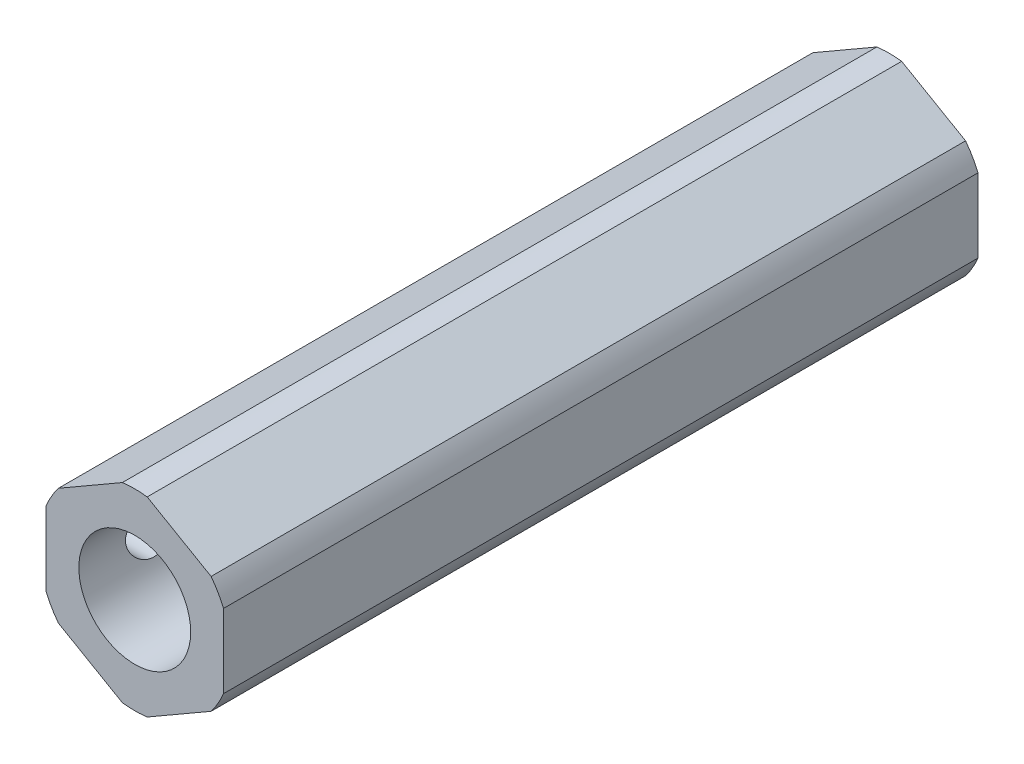
ISO-10303-21;
HEADER;
FILE_DESCRIPTION(('STEP AP214'),'2;1');
FILE_NAME('part.step','',(''),(''),'','','');
FILE_SCHEMA(('AUTOMOTIVE_DESIGN { 1 0 10303 214 1 1 1 1 }'));
ENDSEC;
DATA;
#1=APPLICATION_CONTEXT('core data for automotive mechanical design processes');
#2=APPLICATION_PROTOCOL_DEFINITION('international standard','automotive_design',2000,#1);
#3=PRODUCT_CONTEXT('',#1,'mechanical');
#4=PRODUCT('Part','Part','',(#3));
#5=PRODUCT_RELATED_PRODUCT_CATEGORY('part','',(#4));
#6=PRODUCT_DEFINITION_FORMATION('','',#4);
#7=PRODUCT_DEFINITION_CONTEXT('part definition',#1,'design');
#8=PRODUCT_DEFINITION('design','',#6,#7);
#9=PRODUCT_DEFINITION_SHAPE('','',#8);
#10=(LENGTH_UNIT() NAMED_UNIT(*) SI_UNIT(.MILLI.,.METRE.));
#11=(NAMED_UNIT(*) PLANE_ANGLE_UNIT() SI_UNIT($,.RADIAN.));
#12=(NAMED_UNIT(*) SI_UNIT($,.STERADIAN.) SOLID_ANGLE_UNIT());
#13=UNCERTAINTY_MEASURE_WITH_UNIT(LENGTH_MEASURE(1.E-05),#10,'distance_accuracy_value','');
#14=(GEOMETRIC_REPRESENTATION_CONTEXT(3) GLOBAL_UNCERTAINTY_ASSIGNED_CONTEXT((#13)) GLOBAL_UNIT_ASSIGNED_CONTEXT((#10,
#11,#12)) REPRESENTATION_CONTEXT('',''));
#15=CARTESIAN_POINT('',(0.,0.,0.));
#16=DIRECTION('',(0.,0.,1.));
#17=DIRECTION('',(1.,0.,0.));
#18=AXIS2_PLACEMENT_3D('',#15,#16,#17);
#19=CARTESIAN_POINT('',(0.,0.,-26.9875));
#20=DIRECTION('',(0.,0.,1.));
#21=DIRECTION('',(1.,0.,0.));
#22=AXIS2_PLACEMENT_3D('',#19,#20,#21);
#23=CYLINDRICAL_SURFACE('',#22,2.11582);
#24=CARTESIAN_POINT('',(0.,0.,-26.9875));
#25=DIRECTION('',(0.,0.,1.));
#26=DIRECTION('',(1.,0.,0.));
#27=AXIS2_PLACEMENT_3D('',#24,#25,#26);
#28=CIRCLE('',#27,2.11582);
#29=CARTESIAN_POINT('',(2.11582,0.,-26.9875));
#30=VERTEX_POINT('',#29);
#31=EDGE_CURVE('E166',#30,#30,#28,.T.);
#32=ORIENTED_EDGE('',*,*,#31,.F.);
#33=EDGE_LOOP('',(#32));
#34=FACE_BOUND('',#33,.T.);
#35=CARTESIAN_POINT('',(0.,0.,6.98754));
#36=DIRECTION('',(0.,0.,1.));
#37=DIRECTION('',(1.,0.,0.));
#38=AXIS2_PLACEMENT_3D('',#35,#36,#37);
#39=CIRCLE('',#38,2.11582);
#40=CARTESIAN_POINT('',(2.11582,0.,6.98754));
#41=VERTEX_POINT('',#40);
#42=EDGE_CURVE('E45',#41,#41,#39,.F.);
#43=ORIENTED_EDGE('',*,*,#42,.F.);
#44=EDGE_LOOP('',(#43));
#45=FACE_BOUND('',#44,.T.);
#46=ADVANCED_FACE('F41',(#34,#45),#23,.F.);
#47=CARTESIAN_POINT('',(0.,0.,26.9875));
#48=DIRECTION('',(0.,0.,1.));
#49=DIRECTION('',(1.,0.,0.));
#50=AXIS2_PLACEMENT_3D('',#47,#48,#49);
#51=PLANE('',#50);
#52=CARTESIAN_POINT('',(0.,0.,26.9875));
#53=DIRECTION('',(0.,0.,1.));
#54=DIRECTION('',(1.,0.,0.));
#55=AXIS2_PLACEMENT_3D('',#52,#53,#54);
#56=CIRCLE('',#55,4.);
#57=CARTESIAN_POINT('',(4.,0.,26.9875));
#58=VERTEX_POINT('',#57);
#59=EDGE_CURVE('E261',#58,#58,#56,.T.);
#60=ORIENTED_EDGE('',*,*,#59,.F.);
#61=EDGE_LOOP('',(#60));
#62=FACE_BOUND('',#61,.T.);
#63=CARTESIAN_POINT('',(0.,0.,26.9875));
#64=DIRECTION('',(0.,0.,1.));
#65=DIRECTION('',(1.,0.,0.));
#66=AXIS2_PLACEMENT_3D('',#63,#64,#65);
#67=CIRCLE('',#66,6.87705);
#68=CARTESIAN_POINT('',(5.46158862213451,-4.17909875751589,26.9875));
#69=VERTEX_POINT('',#68);
#70=CARTESIAN_POINT('',(6.35,-2.64032511303059,26.9875));
#71=VERTEX_POINT('',#70);
#72=EDGE_CURVE('E143',#69,#71,#67,.T.);
#73=ORIENTED_EDGE('',*,*,#72,.T.);
#74=DIRECTION('',(0.,1.,0.));
#75=VECTOR('',#74,1.);
#76=CARTESIAN_POINT('',(6.35,-2.64032511303059,26.9875));
#77=LINE('',#76,#75);
#78=CARTESIAN_POINT('',(6.35,2.64032511303059,26.9875));
#79=VERTEX_POINT('',#78);
#80=EDGE_CURVE('E137',#71,#79,#77,.T.);
#81=ORIENTED_EDGE('',*,*,#80,.T.);
#82=CARTESIAN_POINT('',(0.,0.,26.9875));
#83=DIRECTION('',(0.,0.,1.));
#84=DIRECTION('',(1.,0.,0.));
#85=AXIS2_PLACEMENT_3D('',#82,#83,#84);
#86=CIRCLE('',#85,6.87705);
#87=CARTESIAN_POINT('',(5.46158862213451,4.17909875751589,26.9875));
#88=VERTEX_POINT('',#87);
#89=EDGE_CURVE('E140',#79,#88,#86,.T.);
#90=ORIENTED_EDGE('',*,*,#89,.T.);
#91=DIRECTION('',(-0.866025403784439,0.499999999999999,0.));
#92=VECTOR('',#91,1.);
#93=CARTESIAN_POINT('',(5.46158862213451,4.17909875751589,26.9875));
#94=LINE('',#93,#92);
#95=CARTESIAN_POINT('',(0.888411377865485,6.81942387054648,26.9875));
#96=VERTEX_POINT('',#95);
#97=EDGE_CURVE('E59',#88,#96,#94,.T.);
#98=ORIENTED_EDGE('',*,*,#97,.T.);
#99=CARTESIAN_POINT('',(0.,0.,26.9875));
#100=DIRECTION('',(0.,0.,1.));
#101=DIRECTION('',(1.,0.,0.));
#102=AXIS2_PLACEMENT_3D('',#99,#100,#101);
#103=CIRCLE('',#102,6.87705);
#104=CARTESIAN_POINT('',(-0.88841137786549,6.81942387054648,26.9875));
#105=VERTEX_POINT('',#104);
#106=EDGE_CURVE('E190',#96,#105,#103,.T.);
#107=ORIENTED_EDGE('',*,*,#106,.T.);
#108=DIRECTION('',(-0.866025403784439,-0.5,0.));
#109=VECTOR('',#108,1.);
#110=CARTESIAN_POINT('',(-0.88841137786549,6.81942387054648,26.9875));
#111=LINE('',#110,#109);
#112=CARTESIAN_POINT('',(-5.46158862213451,4.17909875751589,26.9875));
#113=VERTEX_POINT('',#112);
#114=EDGE_CURVE('E112',#105,#113,#111,.T.);
#115=ORIENTED_EDGE('',*,*,#114,.T.);
#116=CARTESIAN_POINT('',(0.,0.,26.9875));
#117=DIRECTION('',(0.,0.,1.));
#118=DIRECTION('',(1.,0.,0.));
#119=AXIS2_PLACEMENT_3D('',#116,#117,#118);
#120=CIRCLE('',#119,6.87705);
#121=CARTESIAN_POINT('',(-6.35,2.64032511303059,26.9875));
#122=VERTEX_POINT('',#121);
#123=EDGE_CURVE('E218',#113,#122,#120,.T.);
#124=ORIENTED_EDGE('',*,*,#123,.T.);
#125=DIRECTION('',(0.,-1.,0.));
#126=VECTOR('',#125,1.);
#127=CARTESIAN_POINT('',(-6.35,2.64032511303059,26.9875));
#128=LINE('',#127,#126);
#129=CARTESIAN_POINT('',(-6.35,-2.64032511303059,26.9875));
#130=VERTEX_POINT('',#129);
#131=EDGE_CURVE('E232',#122,#130,#128,.T.);
#132=ORIENTED_EDGE('',*,*,#131,.T.);
#133=CARTESIAN_POINT('',(0.,0.,26.9875));
#134=DIRECTION('',(0.,0.,1.));
#135=DIRECTION('',(1.,0.,0.));
#136=AXIS2_PLACEMENT_3D('',#133,#134,#135);
#137=CIRCLE('',#136,6.87705);
#138=CARTESIAN_POINT('',(-5.46158862213451,-4.17909875751589,26.9875));
#139=VERTEX_POINT('',#138);
#140=EDGE_CURVE('E229',#130,#139,#137,.T.);
#141=ORIENTED_EDGE('',*,*,#140,.T.);
#142=DIRECTION('',(0.866025403784438,-0.5,0.));
#143=VECTOR('',#142,1.);
#144=CARTESIAN_POINT('',(-5.46158862213451,-4.17909875751589,26.9875));
#145=LINE('',#144,#143);
#146=CARTESIAN_POINT('',(-0.888411377865495,-6.81942387054648,26.9875));
#147=VERTEX_POINT('',#146);
#148=EDGE_CURVE('E231',#139,#147,#145,.T.);
#149=ORIENTED_EDGE('',*,*,#148,.T.);
#150=CARTESIAN_POINT('',(0.,0.,26.9875));
#151=DIRECTION('',(0.,0.,1.));
#152=DIRECTION('',(1.,0.,0.));
#153=AXIS2_PLACEMENT_3D('',#150,#151,#152);
#154=CIRCLE('',#153,6.87705);
#155=CARTESIAN_POINT('',(0.888411377865487,-6.81942387054648,26.9875));
#156=VERTEX_POINT('',#155);
#157=EDGE_CURVE('E234',#147,#156,#154,.T.);
#158=ORIENTED_EDGE('',*,*,#157,.T.);
#159=DIRECTION('',(0.866025403784439,0.5,0.));
#160=VECTOR('',#159,1.);
#161=CARTESIAN_POINT('',(0.88841137786549,-6.81942387054648,26.9875));
#162=LINE('',#161,#160);
#163=EDGE_CURVE('E240',#156,#69,#162,.T.);
#164=ORIENTED_EDGE('',*,*,#163,.T.);
#165=EDGE_LOOP('',(#73,#81,#90,#98,#107,#115,#124,#132,#141,#149,#158,#164));
#166=FACE_BOUND('',#165,.T.);
#167=ADVANCED_FACE('F43',(#62,#166),#51,.T.);
#168=CARTESIAN_POINT('',(-0.88841137786549,6.81942387054648,26.9875));
#169=DIRECTION('',(0.5,-0.866025403784439,0.));
#170=DIRECTION('',(0.866025403784439,0.5,0.));
#171=AXIS2_PLACEMENT_3D('',#168,#169,#170);
#172=PLANE('',#171);
#173=DIRECTION('',(0.,0.,-1.));
#174=VECTOR('',#173,1.);
#175=CARTESIAN_POINT('',(-5.46158862213451,4.17909875751589,26.9875));
#176=LINE('',#175,#174);
#177=CARTESIAN_POINT('',(-5.46158862213451,4.17909875751589,-26.9875));
#178=VERTEX_POINT('',#177);
#179=EDGE_CURVE('E51',#113,#178,#176,.T.);
#180=ORIENTED_EDGE('',*,*,#179,.F.);
#181=ORIENTED_EDGE('',*,*,#114,.F.);
#182=DIRECTION('',(0.,0.,-1.));
#183=VECTOR('',#182,1.);
#184=CARTESIAN_POINT('',(-0.88841137786549,6.81942387054648,26.9875));
#185=LINE('',#184,#183);
#186=CARTESIAN_POINT('',(-0.88841137786549,6.81942387054648,-26.9875));
#187=VERTEX_POINT('',#186);
#188=EDGE_CURVE('E11',#105,#187,#185,.T.);
#189=ORIENTED_EDGE('',*,*,#188,.T.);
#190=DIRECTION('',(-0.866025403784439,-0.5,0.));
#191=VECTOR('',#190,1.);
#192=CARTESIAN_POINT('',(-0.88841137786549,6.81942387054648,-26.9875));
#193=LINE('',#192,#191);
#194=EDGE_CURVE('E165',#187,#178,#193,.T.);
#195=ORIENTED_EDGE('',*,*,#194,.T.);
#196=EDGE_LOOP('',(#180,#181,#189,#195));
#197=FACE_BOUND('',#196,.T.);
#198=ADVANCED_FACE('F317',(#197),#172,.F.);
#199=CARTESIAN_POINT('',(-6.35,2.64032511303059,26.9875));
#200=DIRECTION('',(1.,0.,0.));
#201=DIRECTION('',(0.,0.,-1.));
#202=AXIS2_PLACEMENT_3D('',#199,#200,#201);
#203=PLANE('',#202);
#204=CARTESIAN_POINT('',(-6.35,0.,13.98524));
#205=DIRECTION('',(-1.,0.,0.));
#206=DIRECTION('',(0.,0.,1.));
#207=AXIS2_PLACEMENT_3D('',#204,#205,#206);
#208=CIRCLE('',#207,1.66624);
#209=CARTESIAN_POINT('',(-6.35,0.,15.65148));
#210=VERTEX_POINT('',#209);
#211=EDGE_CURVE('E265',#210,#210,#208,.T.);
#212=ORIENTED_EDGE('',*,*,#211,.F.);
#213=EDGE_LOOP('',(#212));
#214=FACE_BOUND('',#213,.T.);
#215=CARTESIAN_POINT('',(-6.35,0.,21.98624));
#216=DIRECTION('',(-1.,0.,0.));
#217=DIRECTION('',(0.,0.,1.));
#218=AXIS2_PLACEMENT_3D('',#215,#216,#217);
#219=CIRCLE('',#218,1.66624);
#220=CARTESIAN_POINT('',(-6.35,0.,23.65248));
#221=VERTEX_POINT('',#220);
#222=EDGE_CURVE('E277',#221,#221,#219,.T.);
#223=ORIENTED_EDGE('',*,*,#222,.F.);
#224=EDGE_LOOP('',(#223));
#225=FACE_BOUND('',#224,.T.);
#226=DIRECTION('',(0.,0.,-1.));
#227=VECTOR('',#226,1.);
#228=CARTESIAN_POINT('',(-6.35,-2.64032511303059,26.9875));
#229=LINE('',#228,#227);
#230=CARTESIAN_POINT('',(-6.35,-2.64032511303059,-26.9875));
#231=VERTEX_POINT('',#230);
#232=EDGE_CURVE('E206',#130,#231,#229,.T.);
#233=ORIENTED_EDGE('',*,*,#232,.F.);
#234=ORIENTED_EDGE('',*,*,#131,.F.);
#235=DIRECTION('',(0.,0.,-1.));
#236=VECTOR('',#235,1.);
#237=CARTESIAN_POINT('',(-6.35,2.64032511303059,26.9875));
#238=LINE('',#237,#236);
#239=CARTESIAN_POINT('',(-6.35,2.64032511303059,-26.9875));
#240=VERTEX_POINT('',#239);
#241=EDGE_CURVE('E209',#122,#240,#238,.T.);
#242=ORIENTED_EDGE('',*,*,#241,.T.);
#243=DIRECTION('',(0.,-1.,0.));
#244=VECTOR('',#243,1.);
#245=CARTESIAN_POINT('',(-6.35,2.64032511303059,-26.9875));
#246=LINE('',#245,#244);
#247=EDGE_CURVE('E171',#240,#231,#246,.T.);
#248=ORIENTED_EDGE('',*,*,#247,.T.);
#249=EDGE_LOOP('',(#233,#234,#242,#248));
#250=FACE_BOUND('',#249,.T.);
#251=ADVANCED_FACE('F223',(#214,#225,#250),#203,.F.);
#252=CARTESIAN_POINT('',(-5.46158862213451,-4.17909875751589,26.9875));
#253=DIRECTION('',(0.5,0.866025403784438,0.));
#254=DIRECTION('',(-0.866025403784439,0.5,0.));
#255=AXIS2_PLACEMENT_3D('',#252,#253,#254);
#256=PLANE('',#255);
#257=DIRECTION('',(0.,0.,-1.));
#258=VECTOR('',#257,1.);
#259=CARTESIAN_POINT('',(-0.888411377865495,-6.81942387054648,26.9875));
#260=LINE('',#259,#258);
#261=CARTESIAN_POINT('',(-0.888411377865495,-6.81942387054648,-26.9875));
#262=VERTEX_POINT('',#261);
#263=EDGE_CURVE('E200',#147,#262,#260,.T.);
#264=ORIENTED_EDGE('',*,*,#263,.F.);
#265=ORIENTED_EDGE('',*,*,#148,.F.);
#266=DIRECTION('',(0.,0.,-1.));
#267=VECTOR('',#266,1.);
#268=CARTESIAN_POINT('',(-5.46158862213451,-4.17909875751589,26.9875));
#269=LINE('',#268,#267);
#270=CARTESIAN_POINT('',(-5.46158862213451,-4.17909875751589,-26.9875));
#271=VERTEX_POINT('',#270);
#272=EDGE_CURVE('E203',#139,#271,#269,.T.);
#273=ORIENTED_EDGE('',*,*,#272,.T.);
#274=DIRECTION('',(0.866025403784438,-0.5,0.));
#275=VECTOR('',#274,1.);
#276=CARTESIAN_POINT('',(-5.46158862213451,-4.17909875751589,-26.9875));
#277=LINE('',#276,#275);
#278=EDGE_CURVE('E176',#271,#262,#277,.T.);
#279=ORIENTED_EDGE('',*,*,#278,.T.);
#280=EDGE_LOOP('',(#264,#265,#273,#279));
#281=FACE_BOUND('',#280,.T.);
#282=ADVANCED_FACE('F306',(#281),#256,.F.);
#283=CARTESIAN_POINT('',(0.88841137786549,-6.81942387054648,26.9875));
#284=DIRECTION('',(-0.5,0.866025403784439,0.));
#285=DIRECTION('',(-0.866025403784439,-0.5,0.));
#286=AXIS2_PLACEMENT_3D('',#283,#284,#285);
#287=PLANE('',#286);
#288=DIRECTION('',(0.,0.,-1.));
#289=VECTOR('',#288,1.);
#290=CARTESIAN_POINT('',(5.46158862213451,-4.17909875751589,26.9875));
#291=LINE('',#290,#289);
#292=CARTESIAN_POINT('',(5.46158862213451,-4.17909875751589,-26.9875));
#293=VERTEX_POINT('',#292);
#294=EDGE_CURVE('E194',#69,#293,#291,.T.);
#295=ORIENTED_EDGE('',*,*,#294,.F.);
#296=ORIENTED_EDGE('',*,*,#163,.F.);
#297=DIRECTION('',(0.,0.,-1.));
#298=VECTOR('',#297,1.);
#299=CARTESIAN_POINT('',(0.888411377865487,-6.81942387054648,26.9875));
#300=LINE('',#299,#298);
#301=CARTESIAN_POINT('',(0.888411377865487,-6.81942387054648,-26.9875));
#302=VERTEX_POINT('',#301);
#303=EDGE_CURVE('E197',#156,#302,#300,.T.);
#304=ORIENTED_EDGE('',*,*,#303,.T.);
#305=DIRECTION('',(0.866025403784439,0.5,0.));
#306=VECTOR('',#305,1.);
#307=CARTESIAN_POINT('',(0.88841137786549,-6.81942387054648,-26.9875));
#308=LINE('',#307,#306);
#309=EDGE_CURVE('E181',#302,#293,#308,.T.);
#310=ORIENTED_EDGE('',*,*,#309,.T.);
#311=EDGE_LOOP('',(#295,#296,#304,#310));
#312=FACE_BOUND('',#311,.T.);
#313=ADVANCED_FACE('F246',(#312),#287,.F.);
#314=CARTESIAN_POINT('',(6.35,-2.64032511303059,26.9875));
#315=DIRECTION('',(-1.,0.,0.));
#316=DIRECTION('',(0.,0.,1.));
#317=AXIS2_PLACEMENT_3D('',#314,#315,#316);
#318=PLANE('',#317);
#319=ORIENTED_EDGE('',*,*,#80,.F.);
#320=DIRECTION('',(0.,0.,-1.));
#321=VECTOR('',#320,1.);
#322=CARTESIAN_POINT('',(6.35,-2.64032511303059,26.9875));
#323=LINE('',#322,#321);
#324=CARTESIAN_POINT('',(6.35,-2.64032511303059,-26.9875));
#325=VERTEX_POINT('',#324);
#326=EDGE_CURVE('E153',#71,#325,#323,.T.);
#327=ORIENTED_EDGE('',*,*,#326,.T.);
#328=DIRECTION('',(0.,1.,0.));
#329=VECTOR('',#328,1.);
#330=CARTESIAN_POINT('',(6.35,-2.64032511303059,-26.9875));
#331=LINE('',#330,#329);
#332=CARTESIAN_POINT('',(6.35,2.64032511303059,-26.9875));
#333=VERTEX_POINT('',#332);
#334=EDGE_CURVE('E151',#325,#333,#331,.T.);
#335=ORIENTED_EDGE('',*,*,#334,.T.);
#336=DIRECTION('',(0.,0.,-1.));
#337=VECTOR('',#336,1.);
#338=CARTESIAN_POINT('',(6.35,2.64032511303059,26.9875));
#339=LINE('',#338,#337);
#340=EDGE_CURVE('E149',#79,#333,#339,.T.);
#341=ORIENTED_EDGE('',*,*,#340,.F.);
#342=EDGE_LOOP('',(#319,#327,#335,#341));
#343=FACE_BOUND('',#342,.T.);
#344=ADVANCED_FACE('F150',(#343),#318,.F.);
#345=CARTESIAN_POINT('',(5.46158862213451,4.17909875751589,26.9875));
#346=DIRECTION('',(-0.499999999999999,-0.866025403784439,0.));
#347=DIRECTION('',(0.866025403784439,-0.499999999999999,0.));
#348=AXIS2_PLACEMENT_3D('',#345,#346,#347);
#349=PLANE('',#348);
#350=DIRECTION('',(0.,0.,-1.));
#351=VECTOR('',#350,1.);
#352=CARTESIAN_POINT('',(0.888411377865485,6.81942387054648,26.9875));
#353=LINE('',#352,#351);
#354=CARTESIAN_POINT('',(0.888411377865485,6.81942387054648,-26.9875));
#355=VERTEX_POINT('',#354);
#356=EDGE_CURVE('E158',#96,#355,#353,.T.);
#357=ORIENTED_EDGE('',*,*,#356,.F.);
#358=ORIENTED_EDGE('',*,*,#97,.F.);
#359=DIRECTION('',(0.,0.,-1.));
#360=VECTOR('',#359,1.);
#361=CARTESIAN_POINT('',(5.46158862213451,4.17909875751589,26.9875));
#362=LINE('',#361,#360);
#363=CARTESIAN_POINT('',(5.46158862213451,4.17909875751589,-26.9875));
#364=VERTEX_POINT('',#363);
#365=EDGE_CURVE('E154',#88,#364,#362,.T.);
#366=ORIENTED_EDGE('',*,*,#365,.T.);
#367=DIRECTION('',(-0.866025403784439,0.499999999999999,0.));
#368=VECTOR('',#367,1.);
#369=CARTESIAN_POINT('',(5.46158862213451,4.17909875751589,-26.9875));
#370=LINE('',#369,#368);
#371=EDGE_CURVE('E100',#364,#355,#370,.T.);
#372=ORIENTED_EDGE('',*,*,#371,.T.);
#373=EDGE_LOOP('',(#357,#358,#366,#372));
#374=FACE_BOUND('',#373,.T.);
#375=ADVANCED_FACE('F251',(#374),#349,.F.);
#376=CARTESIAN_POINT('',(0.,0.,26.9875));
#377=DIRECTION('',(0.,0.,-1.));
#378=DIRECTION('',(-1.,0.,0.));
#379=AXIS2_PLACEMENT_3D('',#376,#377,#378);
#380=CYLINDRICAL_SURFACE('',#379,6.87705);
#381=CARTESIAN_POINT('',(0.,0.,-26.9875));
#382=DIRECTION('',(0.,0.,1.));
#383=DIRECTION('',(1.,0.,0.));
#384=AXIS2_PLACEMENT_3D('',#381,#382,#383);
#385=CIRCLE('',#384,6.87705);
#386=EDGE_CURVE('E162',#355,#187,#385,.T.);
#387=ORIENTED_EDGE('',*,*,#386,.T.);
#388=ORIENTED_EDGE('',*,*,#188,.F.);
#389=ORIENTED_EDGE('',*,*,#106,.F.);
#390=ORIENTED_EDGE('',*,*,#356,.T.);
#391=EDGE_LOOP('',(#387,#388,#389,#390));
#392=FACE_BOUND('',#391,.T.);
#393=ADVANCED_FACE('F255',(#392),#380,.T.);
#394=CARTESIAN_POINT('',(0.,0.,26.9875));
#395=DIRECTION('',(0.,0.,-1.));
#396=DIRECTION('',(-1.,0.,0.));
#397=AXIS2_PLACEMENT_3D('',#394,#395,#396);
#398=CYLINDRICAL_SURFACE('',#397,6.87705);
#399=CARTESIAN_POINT('',(0.,0.,-26.9875));
#400=DIRECTION('',(0.,0.,1.));
#401=DIRECTION('',(1.,0.,0.));
#402=AXIS2_PLACEMENT_3D('',#399,#400,#401);
#403=CIRCLE('',#402,6.87705);
#404=EDGE_CURVE('E168',#178,#240,#403,.T.);
#405=ORIENTED_EDGE('',*,*,#404,.T.);
#406=ORIENTED_EDGE('',*,*,#241,.F.);
#407=ORIENTED_EDGE('',*,*,#123,.F.);
#408=ORIENTED_EDGE('',*,*,#179,.T.);
#409=EDGE_LOOP('',(#405,#406,#407,#408));
#410=FACE_BOUND('',#409,.T.);
#411=ADVANCED_FACE('F216',(#410),#398,.T.);
#412=CARTESIAN_POINT('',(0.,0.,26.9875));
#413=DIRECTION('',(0.,0.,-1.));
#414=DIRECTION('',(-1.,0.,0.));
#415=AXIS2_PLACEMENT_3D('',#412,#413,#414);
#416=CYLINDRICAL_SURFACE('',#415,6.87705);
#417=CARTESIAN_POINT('',(0.,0.,-26.9875));
#418=DIRECTION('',(0.,0.,1.));
#419=DIRECTION('',(1.,0.,0.));
#420=AXIS2_PLACEMENT_3D('',#417,#418,#419);
#421=CIRCLE('',#420,6.87705);
#422=EDGE_CURVE('E173',#231,#271,#421,.T.);
#423=ORIENTED_EDGE('',*,*,#422,.T.);
#424=ORIENTED_EDGE('',*,*,#272,.F.);
#425=ORIENTED_EDGE('',*,*,#140,.F.);
#426=ORIENTED_EDGE('',*,*,#232,.T.);
#427=EDGE_LOOP('',(#423,#424,#425,#426));
#428=FACE_BOUND('',#427,.T.);
#429=ADVANCED_FACE('F227',(#428),#416,.T.);
#430=CARTESIAN_POINT('',(0.,0.,26.9875));
#431=DIRECTION('',(0.,0.,-1.));
#432=DIRECTION('',(-1.,0.,0.));
#433=AXIS2_PLACEMENT_3D('',#430,#431,#432);
#434=CYLINDRICAL_SURFACE('',#433,6.87705);
#435=CARTESIAN_POINT('',(0.,0.,-26.9875));
#436=DIRECTION('',(0.,0.,1.));
#437=DIRECTION('',(1.,0.,0.));
#438=AXIS2_PLACEMENT_3D('',#435,#436,#437);
#439=CIRCLE('',#438,6.87705);
#440=EDGE_CURVE('E178',#262,#302,#439,.T.);
#441=ORIENTED_EDGE('',*,*,#440,.T.);
#442=ORIENTED_EDGE('',*,*,#303,.F.);
#443=ORIENTED_EDGE('',*,*,#157,.F.);
#444=ORIENTED_EDGE('',*,*,#263,.T.);
#445=EDGE_LOOP('',(#441,#442,#443,#444));
#446=FACE_BOUND('',#445,.T.);
#447=ADVANCED_FACE('F303',(#446),#434,.T.);
#448=CARTESIAN_POINT('',(0.,0.,26.9875));
#449=DIRECTION('',(0.,0.,-1.));
#450=DIRECTION('',(-1.,0.,0.));
#451=AXIS2_PLACEMENT_3D('',#448,#449,#450);
#452=CYLINDRICAL_SURFACE('',#451,6.87705);
#453=CARTESIAN_POINT('',(0.,0.,-26.9875));
#454=DIRECTION('',(0.,0.,1.));
#455=DIRECTION('',(1.,0.,0.));
#456=AXIS2_PLACEMENT_3D('',#453,#454,#455);
#457=CIRCLE('',#456,6.87705);
#458=EDGE_CURVE('E183',#293,#325,#457,.T.);
#459=ORIENTED_EDGE('',*,*,#458,.T.);
#460=ORIENTED_EDGE('',*,*,#326,.F.);
#461=ORIENTED_EDGE('',*,*,#72,.F.);
#462=ORIENTED_EDGE('',*,*,#294,.T.);
#463=EDGE_LOOP('',(#459,#460,#461,#462));
#464=FACE_BOUND('',#463,.T.);
#465=ADVANCED_FACE('F249',(#464),#452,.T.);
#466=CARTESIAN_POINT('',(0.,0.,26.9875));
#467=DIRECTION('',(0.,0.,-1.));
#468=DIRECTION('',(-1.,0.,0.));
#469=AXIS2_PLACEMENT_3D('',#466,#467,#468);
#470=CYLINDRICAL_SURFACE('',#469,6.87705);
#471=CARTESIAN_POINT('',(0.,0.,-26.9875));
#472=DIRECTION('',(0.,0.,1.));
#473=DIRECTION('',(1.,0.,0.));
#474=AXIS2_PLACEMENT_3D('',#471,#472,#473);
#475=CIRCLE('',#474,6.87705);
#476=EDGE_CURVE('E187',#333,#364,#475,.T.);
#477=ORIENTED_EDGE('',*,*,#476,.T.);
#478=ORIENTED_EDGE('',*,*,#365,.F.);
#479=ORIENTED_EDGE('',*,*,#89,.F.);
#480=ORIENTED_EDGE('',*,*,#340,.T.);
#481=EDGE_LOOP('',(#477,#478,#479,#480));
#482=FACE_BOUND('',#481,.T.);
#483=ADVANCED_FACE('F156',(#482),#470,.T.);
#484=CARTESIAN_POINT('',(0.,0.,-26.9875));
#485=DIRECTION('',(0.,0.,1.));
#486=DIRECTION('',(1.,0.,0.));
#487=AXIS2_PLACEMENT_3D('',#484,#485,#486);
#488=PLANE('',#487);
#489=ORIENTED_EDGE('',*,*,#31,.T.);
#490=EDGE_LOOP('',(#489));
#491=FACE_BOUND('',#490,.T.);
#492=ORIENTED_EDGE('',*,*,#371,.F.);
#493=ORIENTED_EDGE('',*,*,#476,.F.);
#494=ORIENTED_EDGE('',*,*,#334,.F.);
#495=ORIENTED_EDGE('',*,*,#458,.F.);
#496=ORIENTED_EDGE('',*,*,#309,.F.);
#497=ORIENTED_EDGE('',*,*,#440,.F.);
#498=ORIENTED_EDGE('',*,*,#278,.F.);
#499=ORIENTED_EDGE('',*,*,#422,.F.);
#500=ORIENTED_EDGE('',*,*,#247,.F.);
#501=ORIENTED_EDGE('',*,*,#404,.F.);
#502=ORIENTED_EDGE('',*,*,#194,.F.);
#503=ORIENTED_EDGE('',*,*,#386,.F.);
#504=EDGE_LOOP('',(#492,#493,#494,#495,#496,#497,#498,#499,#500,#501,#502,#503));
#505=FACE_BOUND('',#504,.T.);
#506=ADVANCED_FACE('F219',(#491,#505),#488,.F.);
#507=CARTESIAN_POINT('',(0.,0.,6.98754));
#508=DIRECTION('',(0.,0.,1.));
#509=DIRECTION('',(1.,0.,0.));
#510=AXIS2_PLACEMENT_3D('',#507,#508,#509);
#511=PLANE('',#510);
#512=CARTESIAN_POINT('',(0.,0.,6.98754));
#513=DIRECTION('',(0.,0.,1.));
#514=DIRECTION('',(1.,0.,0.));
#515=AXIS2_PLACEMENT_3D('',#512,#513,#514);
#516=CIRCLE('',#515,4.);
#517=CARTESIAN_POINT('',(4.,0.,6.98754));
#518=VERTEX_POINT('',#517);
#519=EDGE_CURVE('E264',#518,#518,#516,.T.);
#520=ORIENTED_EDGE('',*,*,#519,.T.);
#521=EDGE_LOOP('',(#520));
#522=FACE_BOUND('',#521,.T.);
#523=ORIENTED_EDGE('',*,*,#42,.T.);
#524=EDGE_LOOP('',(#523));
#525=FACE_BOUND('',#524,.T.);
#526=ADVANCED_FACE('F284',(#522,#525),#511,.T.);
#527=CARTESIAN_POINT('',(0.,0.,6.98754));
#528=DIRECTION('',(0.,0.,1.));
#529=DIRECTION('',(1.,0.,0.));
#530=AXIS2_PLACEMENT_3D('',#527,#528,#529);
#531=CYLINDRICAL_SURFACE('',#530,4.);
#532=CARTESIAN_POINT('',(-4.,0.,15.65148));
#533=CARTESIAN_POINT('',(-3.99999278615686,-0.0892564950838416,15.6514704028025));
#534=CARTESIAN_POINT('',(-3.99697785252806,-0.178653445874408,15.6442655852757));
#535=CARTESIAN_POINT('',(-3.98520895826679,-0.354913741163095,15.615702092414));
#536=CARTESIAN_POINT('',(-3.97644001809522,-0.441769852844397,15.5943064722601));
#537=CARTESIAN_POINT('',(-3.95410531852721,-0.610109779316257,15.5382886912356));
#538=CARTESIAN_POINT('',(-3.94055581629255,-0.691610704733506,15.5037113255739));
#539=CARTESIAN_POINT('',(-3.90997942026184,-0.847576254002892,15.4224964109452));
#540=CARTESIAN_POINT('',(-3.89295358110795,-0.92204300186783,15.3758625185168));
#541=CARTESIAN_POINT('',(-3.85617282951429,-1.06568209919382,15.2693862361953));
#542=CARTESIAN_POINT('',(-3.83632857309114,-1.13445507097262,15.2090362097413));
#543=CARTESIAN_POINT('',(-3.79653535169262,-1.26124697953997,15.0779140882311));
#544=CARTESIAN_POINT('',(-3.77658633725556,-1.31926025676097,15.0071365432523));
#545=CARTESIAN_POINT('',(-3.73774506509654,-1.42570450011951,14.8529495530044));
#546=CARTESIAN_POINT('',(-3.71895300286823,-1.47352402441445,14.769090107288));
#547=CARTESIAN_POINT('',(-3.68597008124344,-1.55420022100683,14.5936215027468));
#548=CARTESIAN_POINT('',(-3.67177685378599,-1.58706459764031,14.5020163631247));
#549=CARTESIAN_POINT('',(-3.6505655523416,-1.63524863717173,14.3182533770323));
#550=CARTESIAN_POINT('',(-3.64323489229324,-1.65133690512306,14.2263345362413));
#551=CARTESIAN_POINT('',(-3.63567986362934,-1.66790999232106,14.0408321602338));
#552=CARTESIAN_POINT('',(-3.63545157880415,-1.66840341048233,13.9472495708844));
#553=CARTESIAN_POINT('',(-3.6418625319979,-1.65435174165026,13.7687301143182));
#554=CARTESIAN_POINT('',(-3.64797697270696,-1.64095589411801,13.6836801566712));
#555=CARTESIAN_POINT('',(-3.66549761588335,-1.60143357359013,13.5171677940702));
#556=CARTESIAN_POINT('',(-3.67690483115058,-1.57530466400881,13.4357060790131));
#557=CARTESIAN_POINT('',(-3.70398329076342,-1.51054865952292,13.2766262145337));
#558=CARTESIAN_POINT('',(-3.71974008581751,-1.47166750232053,13.1991267022226));
#559=CARTESIAN_POINT('',(-3.75372239167387,-1.38269032288986,13.0514508700367));
#560=CARTESIAN_POINT('',(-3.77194887463804,-1.33258987923482,12.9812774533443));
#561=CARTESIAN_POINT('',(-3.81068981593156,-1.21762843949499,12.8440075189551));
#562=CARTESIAN_POINT('',(-3.83126749499628,-1.15187813276033,12.7776715180515));
#563=CARTESIAN_POINT('',(-3.8710932221594,-1.00998203418172,12.6567123541156));
#564=CARTESIAN_POINT('',(-3.89034095839519,-0.933833816472901,12.6020919320317));
#565=CARTESIAN_POINT('',(-3.92589646388082,-0.770993354834365,12.504999925822));
#566=CARTESIAN_POINT('',(-3.94212620606392,-0.684098465523779,12.4628375244231));
#567=CARTESIAN_POINT('',(-3.96921825305863,-0.503600517363096,12.3939960456943));
#568=CARTESIAN_POINT('',(-3.9800835221702,-0.410001196065357,12.3673084158913));
#569=CARTESIAN_POINT('',(-3.99466874321172,-0.225106983862133,12.3317654625994));
#570=CARTESIAN_POINT('',(-3.99879697140909,-0.134040460858859,12.321889506907));
#571=CARTESIAN_POINT('',(-4.00074606368991,0.0485347036548915,12.3172076391928));
#572=CARTESIAN_POINT('',(-3.99856873744886,0.140043210791822,12.322397403355));
#573=CARTESIAN_POINT('',(-3.98841618421731,0.31612630684115,12.3469688409706));
#574=CARTESIAN_POINT('',(-3.98073386309435,0.400819702001763,12.3656338930747));
#575=CARTESIAN_POINT('',(-3.96065667675385,0.565780678490782,12.4156288588101));
#576=CARTESIAN_POINT('',(-3.94826121610917,0.646047699152413,12.4469603726707));
#577=CARTESIAN_POINT('',(-3.91946786054283,0.802691549338795,12.5224223675137));
#578=CARTESIAN_POINT('',(-3.90295760265426,0.878870098792284,12.5669201768034));
#579=CARTESIAN_POINT('',(-3.86769708757404,1.02295157864902,12.667047944324));
#580=CARTESIAN_POINT('',(-3.84894589669467,1.09085103558651,12.7226825492779));
#581=CARTESIAN_POINT('',(-3.80956887713304,1.22154465917045,12.8481541685787));
#582=CARTESIAN_POINT('',(-3.78890481691924,1.28362770277841,12.9187218049277));
#583=CARTESIAN_POINT('',(-3.74923247333857,1.3952687494099,13.0696036225403));
#584=CARTESIAN_POINT('',(-3.73022456591773,1.44482391343902,13.1499200069153));
#585=CARTESIAN_POINT('',(-3.69589386836082,1.5305358471205,13.3196739656767));
#586=CARTESIAN_POINT('',(-3.68062729029319,1.56649218978061,13.4092249479498));
#587=CARTESIAN_POINT('',(-3.65628375609074,1.62251020402727,13.5939460476306));
#588=CARTESIAN_POINT('',(-3.64720170060919,1.64258497272038,13.6891114652145));
#589=CARTESIAN_POINT('',(-3.63703400080563,1.6649687384726,13.8744698378238));
#590=CARTESIAN_POINT('',(-3.63538683997242,1.66852587675845,13.9644819641988));
#591=CARTESIAN_POINT('',(-3.63878372032672,1.6611051327531,14.1437670163484));
#592=CARTESIAN_POINT('',(-3.6438267355733,1.6501294790713,14.2330400533502));
#593=CARTESIAN_POINT('',(-3.65952264526222,1.61500295937027,14.4040354375588));
#594=CARTESIAN_POINT('',(-3.66990374316815,1.59148854964911,14.4859158571466));
#595=CARTESIAN_POINT('',(-3.69489312111697,1.53257405322683,14.6445881970623));
#596=CARTESIAN_POINT('',(-3.70950258867739,1.49717062710361,14.7213786804496));
#597=CARTESIAN_POINT('',(-3.74239151805826,1.41303218325127,14.8727294249868));
#598=CARTESIAN_POINT('',(-3.76083879746375,1.36362371730694,14.9468781591778));
#599=CARTESIAN_POINT('',(-3.79885581326801,1.25382110358067,15.0862228829945));
#600=CARTESIAN_POINT('',(-3.81842593693409,1.19342314975632,15.1514157571225));
#601=CARTESIAN_POINT('',(-3.85819446481438,1.05813689614619,15.2758795538898));
#602=CARTESIAN_POINT('',(-3.87833493399613,0.982513913267837,15.3343741566699));
#603=CARTESIAN_POINT('',(-3.91554273539295,0.821778431995704,15.4378824365446));
#604=CARTESIAN_POINT('',(-3.93260866567196,0.73666163308493,15.4828899699446));
#605=CARTESIAN_POINT('',(-3.96149750963462,0.560677876142256,15.5571723352319));
#606=CARTESIAN_POINT('',(-3.97340250049154,0.469929359680299,15.5866951536949));
#607=CARTESIAN_POINT('',(-3.99096249657124,0.284318986119759,15.6297874138548));
#608=CARTESIAN_POINT('',(-3.99663706864898,0.189470984620402,15.643406809435));
#609=CARTESIAN_POINT('',(-3.99963188353466,0.0628638204102649,15.6505939764965));
#610=CARTESIAN_POINT('',(-4.00000254107816,0.0314406240947044,15.6514833806154));
#611=CARTESIAN_POINT('',(-4.,0.,15.65148));
#612=B_SPLINE_CURVE_WITH_KNOTS('',3,(#532,#533,#534,#535,#536,#537,#538,#539,#540,#541,#542,
#543,#544,#545,#546,#547,#548,#549,#550,#551,#552,#553,#554,#555,#556,#557,#558,#559,#560,#561,
#562,#563,#564,#565,#566,#567,#568,#569,#570,#571,#572,#573,#574,#575,#576,#577,#578,#579,#580,
#581,#582,#583,#584,#585,#586,#587,#588,#589,#590,#591,#592,#593,#594,#595,#596,#597,#598,#599,
#600,#601,#602,#603,#604,#605,#606,#607,#608,#609,#610,#611),.UNSPECIFIED.,.T.,.F.,(4,2,2,2,2,2,
2,2,2,2,2,2,2,2,2,2,2,2,2,2,2,2,2,2,2,2,2,2,2,2,2,2,2,2,2,2,2,2,2,4),(0.,0.267680035063576,
0.53605970732993,0.8035353660556,1.07092999895302,1.35058652498936,1.63038973492234,
1.92395126311833,2.2173613876443,2.49664339440191,2.77577140390534,3.03351475440056,
3.29130744577816,3.55458445069367,3.81796539403564,4.10359255775945,4.3892864734055,
4.68156820581396,4.97368824794634,5.2473417122141,5.52091664653013,5.78092347326918,
6.04096315848467,6.30908012294111,6.57730919072872,6.86469808720153,7.15215205179525,
7.44369130849504,7.73498988926461,8.0038743566524,8.27271759527595,8.5290581685435,
8.78547080381735,9.05729658148383,9.329216681703,9.6209270958206,9.91277018997307,
10.1997845504484,10.485894930612,10.5801852940437),.UNSPECIFIED.);
#613=CARTESIAN_POINT('',(-4.,0.,15.65148));
#614=VERTEX_POINT('',#613);
#615=EDGE_CURVE('E276',#614,#614,#612,.T.);
#616=ORIENTED_EDGE('',*,*,#615,.F.);
#617=EDGE_LOOP('',(#616));
#618=FACE_BOUND('',#617,.T.);
#619=CARTESIAN_POINT('',(-4.,0.,23.65248));
#620=CARTESIAN_POINT('',(-3.99999278615686,-0.0892564950838412,23.6524704028025));
#621=CARTESIAN_POINT('',(-3.99697785252806,-0.178653445874408,23.6452655852757));
#622=CARTESIAN_POINT('',(-3.98520895826679,-0.354913741163095,23.616702092414));
#623=CARTESIAN_POINT('',(-3.97644001809522,-0.441769852844397,23.5953064722601));
#624=CARTESIAN_POINT('',(-3.95410531852721,-0.610109779316256,23.5392886912356));
#625=CARTESIAN_POINT('',(-3.94055581629255,-0.691610704733505,23.5047113255739));
#626=CARTESIAN_POINT('',(-3.90997942026184,-0.84757625400289,23.4234964109452));
#627=CARTESIAN_POINT('',(-3.89295358110795,-0.92204300186783,23.3768625185168));
#628=CARTESIAN_POINT('',(-3.85617282951429,-1.06568209919381,23.2703862361953));
#629=CARTESIAN_POINT('',(-3.83632857309114,-1.13445507097261,23.2100362097413));
#630=CARTESIAN_POINT('',(-3.79653535169262,-1.26124697953997,23.0789140882311));
#631=CARTESIAN_POINT('',(-3.77658633725556,-1.31926025676097,23.0081365432523));
#632=CARTESIAN_POINT('',(-3.73774506509654,-1.42570450011951,22.8539495530044));
#633=CARTESIAN_POINT('',(-3.71895300286823,-1.47352402441445,22.770090107288));
#634=CARTESIAN_POINT('',(-3.68597008124344,-1.55420022100682,22.5946215027468));
#635=CARTESIAN_POINT('',(-3.671776853786,-1.58706459764031,22.5030163631247));
#636=CARTESIAN_POINT('',(-3.6505655523416,-1.63524863717173,22.3192533770323));
#637=CARTESIAN_POINT('',(-3.64323489229324,-1.65133690512306,22.2273345362413));
#638=CARTESIAN_POINT('',(-3.63567986362934,-1.66790999232106,22.0418321602338));
#639=CARTESIAN_POINT('',(-3.63545157880415,-1.66840341048233,21.9482495708844));
#640=CARTESIAN_POINT('',(-3.6418625319979,-1.65435174165026,21.7697301143182));
#641=CARTESIAN_POINT('',(-3.64797697270696,-1.640955894118,21.6846801566712));
#642=CARTESIAN_POINT('',(-3.66549761588335,-1.60143357359013,21.5181677940702));
#643=CARTESIAN_POINT('',(-3.67690483115058,-1.57530466400881,21.436706079013));
#644=CARTESIAN_POINT('',(-3.70398329076342,-1.51054865952292,21.2776262145337));
#645=CARTESIAN_POINT('',(-3.71974008581751,-1.47166750232053,21.2001267022226));
#646=CARTESIAN_POINT('',(-3.75372239167387,-1.38269032288985,21.0524508700367));
#647=CARTESIAN_POINT('',(-3.77194887463805,-1.33258987923481,20.9822774533443));
#648=CARTESIAN_POINT('',(-3.81068981593157,-1.21762843949498,20.8450075189551));
#649=CARTESIAN_POINT('',(-3.83126749499628,-1.15187813276033,20.7786715180515));
#650=CARTESIAN_POINT('',(-3.8710932221594,-1.00998203418171,20.6577123541156));
#651=CARTESIAN_POINT('',(-3.89034095839519,-0.933833816472896,20.6030919320317));
#652=CARTESIAN_POINT('',(-3.92589646388082,-0.770993354834362,20.505999925822));
#653=CARTESIAN_POINT('',(-3.94212620606392,-0.684098465523776,20.4638375244231));
#654=CARTESIAN_POINT('',(-3.96921825305863,-0.503600517363092,20.3949960456943));
#655=CARTESIAN_POINT('',(-3.9800835221702,-0.410001196065354,20.3683084158913));
#656=CARTESIAN_POINT('',(-3.99466874321172,-0.22510698386213,20.3327654625994));
#657=CARTESIAN_POINT('',(-3.99879697140909,-0.134040460858857,20.322889506907));
#658=CARTESIAN_POINT('',(-4.00074606368991,0.0485347036548931,20.3182076391928));
#659=CARTESIAN_POINT('',(-3.99856873744886,0.140043210791824,20.323397403355));
#660=CARTESIAN_POINT('',(-3.98841618421731,0.316126306841152,20.3479688409706));
#661=CARTESIAN_POINT('',(-3.98073386309435,0.400819702001765,20.3666338930747));
#662=CARTESIAN_POINT('',(-3.96065667675384,0.565780678490784,20.4166288588101));
#663=CARTESIAN_POINT('',(-3.94826121610917,0.646047699152415,20.4479603726707));
#664=CARTESIAN_POINT('',(-3.91946786054282,0.802691549338796,20.5234223675137));
#665=CARTESIAN_POINT('',(-3.90295760265426,0.878870098792285,20.5679201768034));
#666=CARTESIAN_POINT('',(-3.86769708757404,1.02295157864902,20.668047944324));
#667=CARTESIAN_POINT('',(-3.84894589669467,1.09085103558651,20.7236825492779));
#668=CARTESIAN_POINT('',(-3.80956887713304,1.22154465917045,20.8491541685788));
#669=CARTESIAN_POINT('',(-3.78890481691924,1.28362770277841,20.9197218049277));
#670=CARTESIAN_POINT('',(-3.74923247333857,1.39526874940991,21.0706036225403));
#671=CARTESIAN_POINT('',(-3.73022456591773,1.44482391343902,21.1509200069153));
#672=CARTESIAN_POINT('',(-3.69589386836082,1.5305358471205,21.3206739656768));
#673=CARTESIAN_POINT('',(-3.68062729029319,1.56649218978061,21.4102249479498));
#674=CARTESIAN_POINT('',(-3.65628375609074,1.62251020402727,21.5949460476306));
#675=CARTESIAN_POINT('',(-3.64720170060919,1.64258497272038,21.6901114652145));
#676=CARTESIAN_POINT('',(-3.63703400080563,1.6649687384726,21.8754698378238));
#677=CARTESIAN_POINT('',(-3.63538683997242,1.66852587675845,21.9654819641988));
#678=CARTESIAN_POINT('',(-3.63878372032672,1.6611051327531,22.1447670163484));
#679=CARTESIAN_POINT('',(-3.6438267355733,1.6501294790713,22.2340400533502));
#680=CARTESIAN_POINT('',(-3.65952264526222,1.61500295937027,22.4050354375588));
#681=CARTESIAN_POINT('',(-3.66990374316815,1.59148854964911,22.4869158571466));
#682=CARTESIAN_POINT('',(-3.69489312111697,1.53257405322683,22.6455881970623));
#683=CARTESIAN_POINT('',(-3.70950258867739,1.49717062710361,22.7223786804495));
#684=CARTESIAN_POINT('',(-3.74239151805826,1.41303218325127,22.8737294249868));
#685=CARTESIAN_POINT('',(-3.76083879746375,1.36362371730694,22.9478781591778));
#686=CARTESIAN_POINT('',(-3.79885581326801,1.25382110358067,23.0872228829945));
#687=CARTESIAN_POINT('',(-3.81842593693409,1.19342314975632,23.1524157571225));
#688=CARTESIAN_POINT('',(-3.85819446481438,1.05813689614618,23.2768795538898));
#689=CARTESIAN_POINT('',(-3.87833493399613,0.982513913267834,23.3353741566699));
#690=CARTESIAN_POINT('',(-3.91554273539295,0.8217784319957,23.4388824365446));
#691=CARTESIAN_POINT('',(-3.93260866567196,0.736661633084926,23.4838899699446));
#692=CARTESIAN_POINT('',(-3.96149750963462,0.560677876142252,23.5581723352319));
#693=CARTESIAN_POINT('',(-3.97340250049154,0.469929359680295,23.5876951536949));
#694=CARTESIAN_POINT('',(-3.99096249657124,0.284318986119756,23.6307874138548));
#695=CARTESIAN_POINT('',(-3.99663706864898,0.1894709846204,23.644406809435));
#696=CARTESIAN_POINT('',(-3.99963188353466,0.0628638204102643,23.6515939764965));
#697=CARTESIAN_POINT('',(-4.00000254107816,0.0314406240947043,23.6524833806154));
#698=CARTESIAN_POINT('',(-4.,0.,23.65248));
#699=B_SPLINE_CURVE_WITH_KNOTS('',3,(#619,#620,#621,#622,#623,#624,#625,#626,#627,#628,#629,
#630,#631,#632,#633,#634,#635,#636,#637,#638,#639,#640,#641,#642,#643,#644,#645,#646,#647,#648,
#649,#650,#651,#652,#653,#654,#655,#656,#657,#658,#659,#660,#661,#662,#663,#664,#665,#666,#667,
#668,#669,#670,#671,#672,#673,#674,#675,#676,#677,#678,#679,#680,#681,#682,#683,#684,#685,#686,
#687,#688,#689,#690,#691,#692,#693,#694,#695,#696,#697,#698),.UNSPECIFIED.,.T.,.F.,(4,2,2,2,2,2,
2,2,2,2,2,2,2,2,2,2,2,2,2,2,2,2,2,2,2,2,2,2,2,2,2,2,2,2,2,2,2,2,2,4),(0.,0.267680035063576,
0.53605970732993,0.803535366055599,1.07092999895302,1.35058652498936,1.63038973492234,
1.92395126311833,2.21736138764429,2.49664339440191,2.77577140390533,3.03351475440056,
3.29130744577816,3.55458445069367,3.81796539403565,4.10359255775945,4.38928647340549,
4.68156820581396,4.97368824794633,5.2473417122141,5.52091664653012,5.78092347326918,
6.04096315848466,6.3090801229411,6.57730919072872,6.86469808720153,7.15215205179525,
7.44369130849504,7.7349898892646,8.0038743566524,8.27271759527594,8.52905816854349,
8.78547080381733,9.05729658148382,9.329216681703,9.62092709582059,9.91277018997306,
10.1997845504484,10.485894930612,10.5801852940437),.UNSPECIFIED.);
#700=CARTESIAN_POINT('',(-4.,0.,23.65248));
#701=VERTEX_POINT('',#700);
#702=EDGE_CURVE('E268',#701,#701,#699,.T.);
#703=ORIENTED_EDGE('',*,*,#702,.F.);
#704=EDGE_LOOP('',(#703));
#705=FACE_BOUND('',#704,.T.);
#706=ORIENTED_EDGE('',*,*,#519,.F.);
#707=EDGE_LOOP('',(#706));
#708=FACE_BOUND('',#707,.T.);
#709=ORIENTED_EDGE('',*,*,#59,.T.);
#710=EDGE_LOOP('',(#709));
#711=FACE_BOUND('',#710,.T.);
#712=ADVANCED_FACE('F287',(#618,#705,#708,#711),#531,.F.);
#713=CARTESIAN_POINT('',(6.351,0.,21.98624));
#714=DIRECTION('',(-1.,0.,0.));
#715=DIRECTION('',(0.,0.,1.));
#716=AXIS2_PLACEMENT_3D('',#713,#714,#715);
#717=CYLINDRICAL_SURFACE('',#716,1.66624);
#718=ORIENTED_EDGE('',*,*,#222,.T.);
#719=EDGE_LOOP('',(#718));
#720=FACE_BOUND('',#719,.T.);
#721=ORIENTED_EDGE('',*,*,#702,.T.);
#722=EDGE_LOOP('',(#721));
#723=FACE_BOUND('',#722,.T.);
#724=ADVANCED_FACE('F279',(#720,#723),#717,.F.);
#725=CARTESIAN_POINT('',(6.351,0.,13.98524));
#726=DIRECTION('',(-1.,0.,0.));
#727=DIRECTION('',(0.,0.,1.));
#728=AXIS2_PLACEMENT_3D('',#725,#726,#727);
#729=CYLINDRICAL_SURFACE('',#728,1.66624);
#730=ORIENTED_EDGE('',*,*,#211,.T.);
#731=EDGE_LOOP('',(#730));
#732=FACE_BOUND('',#731,.T.);
#733=ORIENTED_EDGE('',*,*,#615,.T.);
#734=EDGE_LOOP('',(#733));
#735=FACE_BOUND('',#734,.T.);
#736=ADVANCED_FACE('F352',(#732,#735),#729,.F.);
#737=CLOSED_SHELL('',(#46,#167,#198,#251,#282,#313,#344,#375,#393,#411,#429,#447,#465,#483,#506,
#526,#712,#724,#736));
#738=MANIFOLD_SOLID_BREP('B2',#737);
#739=ADVANCED_BREP_SHAPE_REPRESENTATION('',(#18,#738),#14);
#740=SHAPE_DEFINITION_REPRESENTATION(#9,#739);
ENDSEC;
END-ISO-10303-21;
